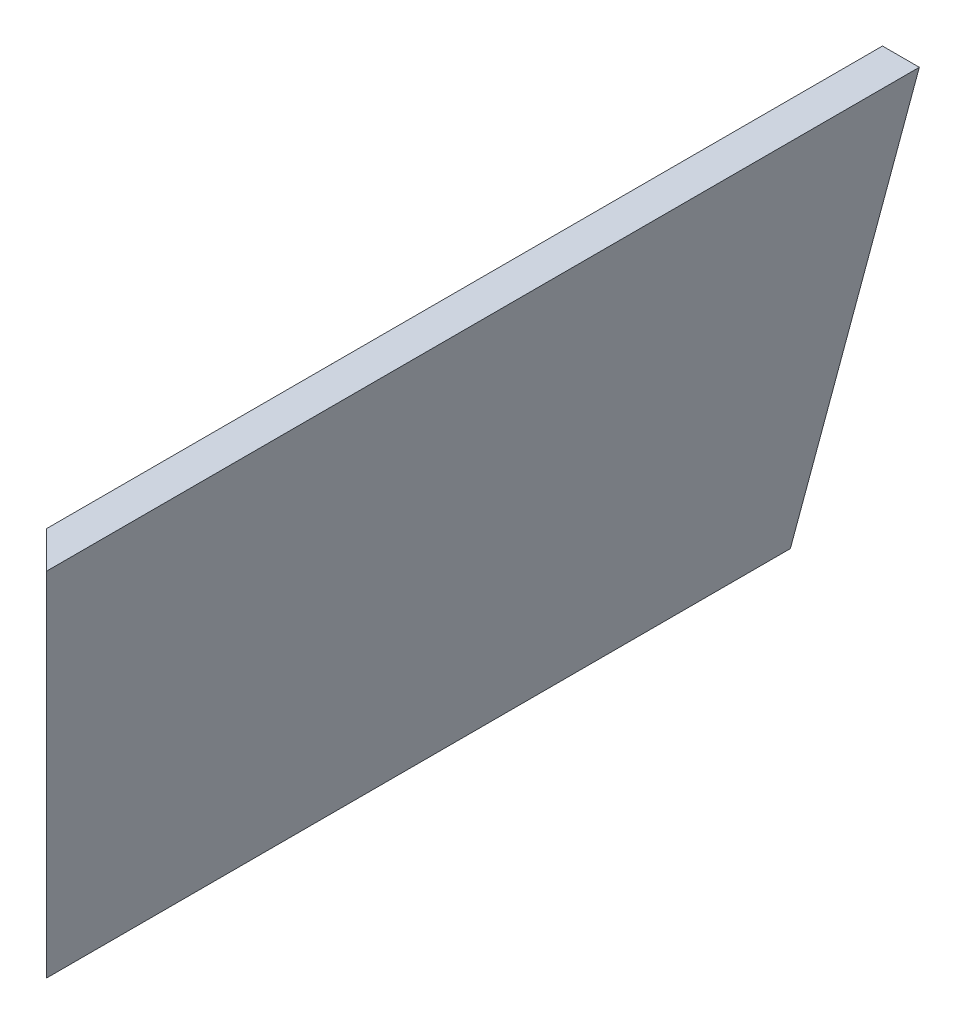
ISO-10303-21;
HEADER;
FILE_DESCRIPTION(('STEP AP214'),'2;1');
FILE_NAME('part.step','',(''),(''),'','','');
FILE_SCHEMA(('AUTOMOTIVE_DESIGN { 1 0 10303 214 1 1 1 1 }'));
ENDSEC;
DATA;
#1=APPLICATION_CONTEXT('core data for automotive mechanical design processes');
#2=APPLICATION_PROTOCOL_DEFINITION('international standard','automotive_design',2000,#1);
#3=PRODUCT_CONTEXT('',#1,'mechanical');
#4=PRODUCT('Part','Part','',(#3));
#5=PRODUCT_RELATED_PRODUCT_CATEGORY('part','',(#4));
#6=PRODUCT_DEFINITION_FORMATION('','',#4);
#7=PRODUCT_DEFINITION_CONTEXT('part definition',#1,'design');
#8=PRODUCT_DEFINITION('design','',#6,#7);
#9=PRODUCT_DEFINITION_SHAPE('','',#8);
#10=(LENGTH_UNIT() NAMED_UNIT(*) SI_UNIT(.MILLI.,.METRE.));
#11=(NAMED_UNIT(*) PLANE_ANGLE_UNIT() SI_UNIT($,.RADIAN.));
#12=(NAMED_UNIT(*) SI_UNIT($,.STERADIAN.) SOLID_ANGLE_UNIT());
#13=UNCERTAINTY_MEASURE_WITH_UNIT(LENGTH_MEASURE(1.E-05),#10,'distance_accuracy_value','');
#14=(GEOMETRIC_REPRESENTATION_CONTEXT(3) GLOBAL_UNCERTAINTY_ASSIGNED_CONTEXT((#13)) GLOBAL_UNIT_ASSIGNED_CONTEXT((#10,
#11,#12)) REPRESENTATION_CONTEXT('',''));
#15=CARTESIAN_POINT('',(0.,0.,0.));
#16=DIRECTION('',(0.,0.,1.));
#17=DIRECTION('',(1.,0.,0.));
#18=AXIS2_PLACEMENT_3D('',#15,#16,#17);
#19=CARTESIAN_POINT('',(298.198418728019,171.741611914197,501.031293715292));
#20=DIRECTION('',(0.96592582628907,-0.258819045102514,0.));
#21=DIRECTION('',(0.258819045102514,0.96592582628907,0.));
#22=AXIS2_PLACEMENT_3D('',#19,#20,#21);
#23=PLANE('',#22);
#24=DIRECTION('',(-0.250562807085726,-0.935113126531032,-0.250562807085726));
#25=VECTOR('',#24,1.);
#26=CARTESIAN_POINT('',(310.932615552035,219.26628145501,310.932615552035));
#27=LINE('',#26,#25);
#28=CARTESIAN_POINT('',(298.198418728019,171.741611914197,298.198418728019));
#29=VERTEX_POINT('',#28);
#30=CARTESIAN_POINT('',(252.180392508792,0.,252.180392508792));
#31=VERTEX_POINT('',#30);
#32=EDGE_CURVE('E90',#29,#31,#27,.T.);
#33=ORIENTED_EDGE('',*,*,#32,.F.);
#34=DIRECTION('',(0.,0.,-1.));
#35=VECTOR('',#34,1.);
#36=CARTESIAN_POINT('',(298.198418728019,171.741611914197,501.031293715292));
#37=LINE('',#36,#35);
#38=CARTESIAN_POINT('',(298.198418728019,171.741611914197,0.));
#39=VERTEX_POINT('',#38);
#40=EDGE_CURVE('E43',#29,#39,#37,.T.);
#41=ORIENTED_EDGE('',*,*,#40,.T.);
#42=DIRECTION('',(-0.258819045102514,-0.96592582628907,0.));
#43=VECTOR('',#42,1.);
#44=CARTESIAN_POINT('',(298.198418728019,171.741611914197,0.));
#45=LINE('',#44,#43);
#46=CARTESIAN_POINT('',(252.180392508792,0.,0.));
#47=VERTEX_POINT('',#46);
#48=EDGE_CURVE('E88',#39,#47,#45,.T.);
#49=ORIENTED_EDGE('',*,*,#48,.T.);
#50=DIRECTION('',(0.,0.,-1.));
#51=VECTOR('',#50,1.);
#52=CARTESIAN_POINT('',(252.180392508792,0.,501.031293715292));
#53=LINE('',#52,#51);
#54=EDGE_CURVE('E79',#31,#47,#53,.T.);
#55=ORIENTED_EDGE('',*,*,#54,.F.);
#56=EDGE_LOOP('',(#33,#41,#49,#55));
#57=FACE_BOUND('',#56,.T.);
#58=ADVANCED_FACE('F39',(#57),#23,.F.);
#59=CARTESIAN_POINT('',(252.180392508792,0.,501.031293715292));
#60=DIRECTION('',(0.,1.,0.));
#61=DIRECTION('',(0.,0.,1.));
#62=AXIS2_PLACEMENT_3D('',#59,#60,#61);
#63=PLANE('',#62);
#64=DIRECTION('',(0.707106781186548,0.,0.707106781186547));
#65=VECTOR('',#64,1.);
#66=CARTESIAN_POINT('',(376.605843112042,0.,376.605843112042));
#67=LINE('',#66,#65);
#68=CARTESIAN_POINT('',(265.3284,0.,265.3284));
#69=VERTEX_POINT('',#68);
#70=EDGE_CURVE('E49',#31,#69,#67,.T.);
#71=ORIENTED_EDGE('',*,*,#70,.F.);
#72=ORIENTED_EDGE('',*,*,#54,.T.);
#73=DIRECTION('',(1.,0.,0.));
#74=VECTOR('',#73,1.);
#75=CARTESIAN_POINT('',(252.180392508792,0.,0.));
#76=LINE('',#75,#74);
#77=CARTESIAN_POINT('',(265.3284,0.,0.));
#78=VERTEX_POINT('',#77);
#79=EDGE_CURVE('E102',#47,#78,#76,.T.);
#80=ORIENTED_EDGE('',*,*,#79,.T.);
#81=DIRECTION('',(0.,0.,-1.));
#82=VECTOR('',#81,1.);
#83=CARTESIAN_POINT('',(265.3284,0.,501.031293715292));
#84=LINE('',#83,#82);
#85=EDGE_CURVE('E116',#69,#78,#84,.T.);
#86=ORIENTED_EDGE('',*,*,#85,.F.);
#87=EDGE_LOOP('',(#71,#72,#80,#86));
#88=FACE_BOUND('',#87,.T.);
#89=ADVANCED_FACE('F123',(#88),#63,.F.);
#90=CARTESIAN_POINT('',(265.3284,0.,501.031293715292));
#91=DIRECTION('',(-0.96592582628907,0.258819045102514,0.));
#92=DIRECTION('',(-0.258819045102514,-0.96592582628907,0.));
#93=AXIS2_PLACEMENT_3D('',#90,#91,#92);
#94=PLANE('',#93);
#95=DIRECTION('',(0.250562807085726,0.935113126531032,0.250562807085726));
#96=VECTOR('',#95,1.);
#97=CARTESIAN_POINT('',(280.12623314588,55.2262651423518,280.12623314588));
#98=LINE('',#97,#96);
#99=CARTESIAN_POINT('',(311.346426219227,171.741611914197,311.346426219227));
#100=VERTEX_POINT('',#99);
#101=EDGE_CURVE('E11',#69,#100,#98,.T.);
#102=ORIENTED_EDGE('',*,*,#101,.F.);
#103=ORIENTED_EDGE('',*,*,#85,.T.);
#104=DIRECTION('',(0.258819045102514,0.96592582628907,0.));
#105=VECTOR('',#104,1.);
#106=CARTESIAN_POINT('',(265.3284,0.,0.));
#107=LINE('',#106,#105);
#108=CARTESIAN_POINT('',(311.346426219227,171.741611914197,0.));
#109=VERTEX_POINT('',#108);
#110=EDGE_CURVE('E118',#78,#109,#107,.T.);
#111=ORIENTED_EDGE('',*,*,#110,.T.);
#112=DIRECTION('',(0.,0.,-1.));
#113=VECTOR('',#112,1.);
#114=CARTESIAN_POINT('',(311.346426219227,171.741611914197,501.031293715292));
#115=LINE('',#114,#113);
#116=EDGE_CURVE('E62',#100,#109,#115,.T.);
#117=ORIENTED_EDGE('',*,*,#116,.F.);
#118=EDGE_LOOP('',(#102,#103,#111,#117));
#119=FACE_BOUND('',#118,.T.);
#120=ADVANCED_FACE('F122',(#119),#94,.F.);
#121=CARTESIAN_POINT('',(311.346426219227,171.741611914197,501.031293715292));
#122=DIRECTION('',(0.,-1.,0.));
#123=DIRECTION('',(0.,0.,-1.));
#124=AXIS2_PLACEMENT_3D('',#121,#122,#123);
#125=PLANE('',#124);
#126=DIRECTION('',(-0.707106781186548,0.,-0.707106781186547));
#127=VECTOR('',#126,1.);
#128=CARTESIAN_POINT('',(406.18885996726,171.741611914197,406.188859967259));
#129=LINE('',#128,#127);
#130=EDGE_CURVE('E99',#100,#29,#129,.T.);
#131=ORIENTED_EDGE('',*,*,#130,.F.);
#132=ORIENTED_EDGE('',*,*,#116,.T.);
#133=DIRECTION('',(-1.,0.,0.));
#134=VECTOR('',#133,1.);
#135=CARTESIAN_POINT('',(311.346426219227,171.741611914197,0.));
#136=LINE('',#135,#134);
#137=EDGE_CURVE('E94',#109,#39,#136,.T.);
#138=ORIENTED_EDGE('',*,*,#137,.T.);
#139=ORIENTED_EDGE('',*,*,#40,.F.);
#140=EDGE_LOOP('',(#131,#132,#138,#139));
#141=FACE_BOUND('',#140,.T.);
#142=ADVANCED_FACE('F95',(#141),#125,.F.);
#143=CARTESIAN_POINT('',(0.,0.,0.));
#144=DIRECTION('',(0.,0.,1.));
#145=DIRECTION('',(1.,0.,0.));
#146=AXIS2_PLACEMENT_3D('',#143,#144,#145);
#147=PLANE('',#146);
#148=ORIENTED_EDGE('',*,*,#48,.F.);
#149=ORIENTED_EDGE('',*,*,#137,.F.);
#150=ORIENTED_EDGE('',*,*,#110,.F.);
#151=ORIENTED_EDGE('',*,*,#79,.F.);
#152=EDGE_LOOP('',(#148,#149,#150,#151));
#153=FACE_BOUND('',#152,.T.);
#154=ADVANCED_FACE('F101',(#153),#147,.F.);
#155=CARTESIAN_POINT('',(0.,0.,0.));
#156=DIRECTION('',(-0.707106781186547,0.,0.707106781186548));
#157=DIRECTION('',(0.707106781186548,0.,0.707106781186547));
#158=AXIS2_PLACEMENT_3D('',#155,#156,#157);
#159=PLANE('',#158);
#160=ORIENTED_EDGE('',*,*,#130,.T.);
#161=ORIENTED_EDGE('',*,*,#32,.T.);
#162=ORIENTED_EDGE('',*,*,#70,.T.);
#163=ORIENTED_EDGE('',*,*,#101,.T.);
#164=EDGE_LOOP('',(#160,#161,#162,#163));
#165=FACE_BOUND('',#164,.T.);
#166=ADVANCED_FACE('F41',(#165),#159,.T.);
#167=CLOSED_SHELL('',(#58,#89,#120,#142,#154,#166));
#168=MANIFOLD_SOLID_BREP('B2',#167);
#169=ADVANCED_BREP_SHAPE_REPRESENTATION('',(#18,#168),#14);
#170=SHAPE_DEFINITION_REPRESENTATION(#9,#169);
ENDSEC;
END-ISO-10303-21;
